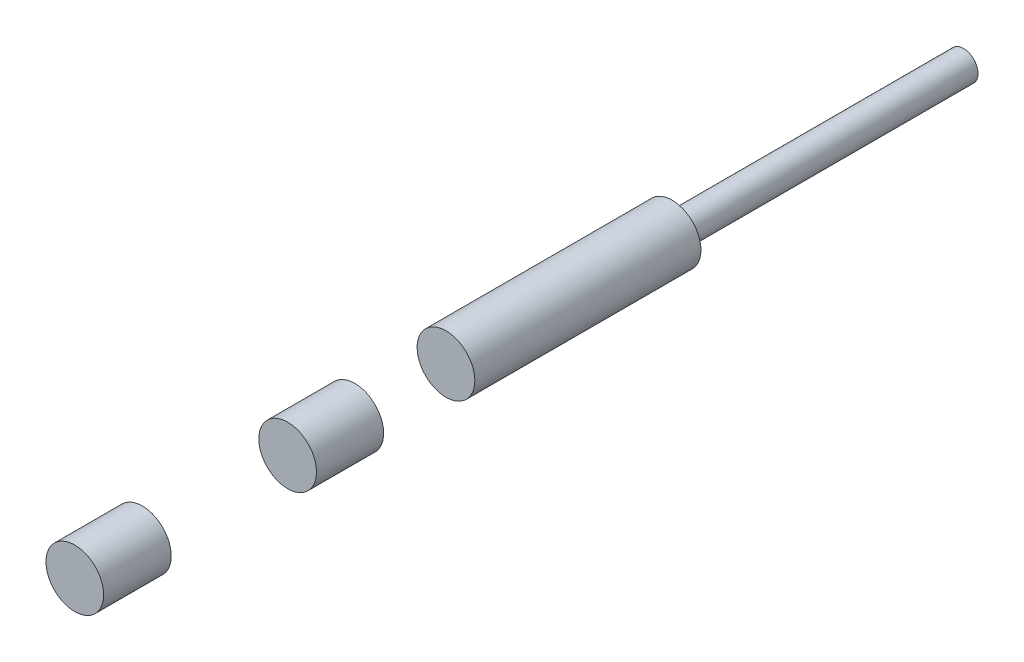
ISO-10303-21;
HEADER;
FILE_DESCRIPTION(('STEP AP214'),'2;1');
FILE_NAME('part.step','',(''),(''),'','','');
FILE_SCHEMA(('AUTOMOTIVE_DESIGN { 1 0 10303 214 1 1 1 1 }'));
ENDSEC;
DATA;
#1=APPLICATION_CONTEXT('core data for automotive mechanical design processes');
#2=APPLICATION_PROTOCOL_DEFINITION('international standard','automotive_design',2000,#1);
#3=PRODUCT_CONTEXT('',#1,'mechanical');
#4=PRODUCT('Part','Part','',(#3));
#5=PRODUCT_RELATED_PRODUCT_CATEGORY('part','',(#4));
#6=PRODUCT_DEFINITION_FORMATION('','',#4);
#7=PRODUCT_DEFINITION_CONTEXT('part definition',#1,'design');
#8=PRODUCT_DEFINITION('design','',#6,#7);
#9=PRODUCT_DEFINITION_SHAPE('','',#8);
#10=(LENGTH_UNIT() NAMED_UNIT(*) SI_UNIT(.MILLI.,.METRE.));
#11=(NAMED_UNIT(*) PLANE_ANGLE_UNIT() SI_UNIT($,.RADIAN.));
#12=(NAMED_UNIT(*) SI_UNIT($,.STERADIAN.) SOLID_ANGLE_UNIT());
#13=UNCERTAINTY_MEASURE_WITH_UNIT(LENGTH_MEASURE(1.E-05),#10,'distance_accuracy_value','');
#14=(GEOMETRIC_REPRESENTATION_CONTEXT(3) GLOBAL_UNCERTAINTY_ASSIGNED_CONTEXT((#13)) GLOBAL_UNIT_ASSIGNED_CONTEXT((#10,
#11,#12)) REPRESENTATION_CONTEXT('',''));
#15=CARTESIAN_POINT('',(0.,0.,0.));
#16=DIRECTION('',(0.,0.,1.));
#17=DIRECTION('',(1.,0.,0.));
#18=AXIS2_PLACEMENT_3D('',#15,#16,#17);
#19=CARTESIAN_POINT('',(0.,0.,-106.));
#20=DIRECTION('',(0.,0.,1.));
#21=DIRECTION('',(1.,0.,0.));
#22=AXIS2_PLACEMENT_3D('',#19,#20,#21);
#23=CYLINDRICAL_SURFACE('',#22,9.9);
#24=CARTESIAN_POINT('',(0.,0.,21.6045352136614));
#25=DIRECTION('',(0.,0.,-1.));
#26=DIRECTION('',(0.,1.,0.));
#27=AXIS2_PLACEMENT_3D('',#24,#25,#26);
#28=CIRCLE('',#27,9.9);
#29=CARTESIAN_POINT('',(0.,9.9,21.6045352136614));
#30=VERTEX_POINT('',#29);
#31=EDGE_CURVE('E12',#30,#30,#28,.F.);
#32=ORIENTED_EDGE('',*,*,#31,.F.);
#33=EDGE_LOOP('',(#32));
#34=FACE_BOUND('',#33,.T.);
#35=CARTESIAN_POINT('',(0.,0.,-56.));
#36=DIRECTION('',(0.,0.,-1.));
#37=DIRECTION('',(-1.,0.,0.));
#38=AXIS2_PLACEMENT_3D('',#35,#36,#37);
#39=CIRCLE('',#38,9.9);
#40=CARTESIAN_POINT('',(-9.9,0.,-56.));
#41=VERTEX_POINT('',#40);
#42=EDGE_CURVE('E70',#41,#41,#39,.T.);
#43=ORIENTED_EDGE('',*,*,#42,.F.);
#44=EDGE_LOOP('',(#43));
#45=FACE_BOUND('',#44,.T.);
#46=ADVANCED_FACE('F55',(#34,#45),#23,.T.);
#47=CARTESIAN_POINT('',(0.,0.,-56.));
#48=DIRECTION('',(0.,0.,-1.));
#49=DIRECTION('',(-1.,0.,0.));
#50=AXIS2_PLACEMENT_3D('',#47,#48,#49);
#51=PLANE('',#50);
#52=CARTESIAN_POINT('',(0.,0.,-56.));
#53=DIRECTION('',(0.,0.,-1.));
#54=DIRECTION('',(-1.,0.,0.));
#55=AXIS2_PLACEMENT_3D('',#52,#53,#54);
#56=CIRCLE('',#55,5.);
#57=CARTESIAN_POINT('',(-5.,0.,-56.));
#58=VERTEX_POINT('',#57);
#59=EDGE_CURVE('E68',#58,#58,#56,.T.);
#60=ORIENTED_EDGE('',*,*,#59,.F.);
#61=EDGE_LOOP('',(#60));
#62=FACE_BOUND('',#61,.T.);
#63=ORIENTED_EDGE('',*,*,#42,.T.);
#64=EDGE_LOOP('',(#63));
#65=FACE_BOUND('',#64,.T.);
#66=ADVANCED_FACE('F80',(#62,#65),#51,.T.);
#67=CARTESIAN_POINT('',(0.,0.,-56.));
#68=DIRECTION('',(0.,0.,-1.));
#69=DIRECTION('',(-1.,0.,0.));
#70=AXIS2_PLACEMENT_3D('',#67,#68,#69);
#71=CYLINDRICAL_SURFACE('',#70,5.);
#72=ORIENTED_EDGE('',*,*,#59,.T.);
#73=EDGE_LOOP('',(#72));
#74=FACE_BOUND('',#73,.T.);
#75=CARTESIAN_POINT('',(0.,0.,-156.));
#76=DIRECTION('',(0.,0.,-1.));
#77=DIRECTION('',(-1.,0.,0.));
#78=AXIS2_PLACEMENT_3D('',#75,#76,#77);
#79=CIRCLE('',#78,5.);
#80=CARTESIAN_POINT('',(-5.,0.,-156.));
#81=VERTEX_POINT('',#80);
#82=EDGE_CURVE('E58',#81,#81,#79,.T.);
#83=ORIENTED_EDGE('',*,*,#82,.F.);
#84=EDGE_LOOP('',(#83));
#85=FACE_BOUND('',#84,.T.);
#86=ADVANCED_FACE('F77',(#74,#85),#71,.T.);
#87=CARTESIAN_POINT('',(0.,0.,-156.));
#88=DIRECTION('',(0.,0.,-1.));
#89=DIRECTION('',(-1.,0.,0.));
#90=AXIS2_PLACEMENT_3D('',#87,#88,#89);
#91=PLANE('',#90);
#92=ORIENTED_EDGE('',*,*,#82,.T.);
#93=EDGE_LOOP('',(#92));
#94=FACE_BOUND('',#93,.T.);
#95=ADVANCED_FACE('F100',(#94),#91,.T.);
#96=CARTESIAN_POINT('',(-80.,20.633864559174,21.6045352136615));
#97=DIRECTION('',(0.,0.,-1.));
#98=DIRECTION('',(0.,1.,0.));
#99=AXIS2_PLACEMENT_3D('',#96,#97,#98);
#100=PLANE('',#99);
#101=ORIENTED_EDGE('',*,*,#31,.T.);
#102=EDGE_LOOP('',(#101));
#103=FACE_BOUND('',#102,.T.);
#104=ADVANCED_FACE('F107',(#103),#100,.F.);
#105=CLOSED_SHELL('',(#46,#66,#86,#95,#104));
#106=MANIFOLD_SOLID_BREP('B2',#105);
#107=CARTESIAN_POINT('',(0.,0.,-106.));
#108=DIRECTION('',(0.,0.,1.));
#109=DIRECTION('',(1.,0.,0.));
#110=AXIS2_PLACEMENT_3D('',#107,#108,#109);
#111=CYLINDRICAL_SURFACE('',#110,9.9);
#112=CARTESIAN_POINT('',(0.,0.,75.940378552819));
#113=DIRECTION('',(0.,0.,-1.));
#114=DIRECTION('',(-1.,0.,0.));
#115=AXIS2_PLACEMENT_3D('',#112,#113,#114);
#116=CIRCLE('',#115,9.9);
#117=CARTESIAN_POINT('',(-9.9,0.,75.940378552819));
#118=VERTEX_POINT('',#117);
#119=EDGE_CURVE('E54',#118,#118,#116,.F.);
#120=ORIENTED_EDGE('',*,*,#119,.F.);
#121=EDGE_LOOP('',(#120));
#122=FACE_BOUND('',#121,.T.);
#123=CARTESIAN_POINT('',(0.,0.,52.899229795075));
#124=DIRECTION('',(0.,0.,1.));
#125=DIRECTION('',(0.,-1.,0.));
#126=AXIS2_PLACEMENT_3D('',#123,#124,#125);
#127=CIRCLE('',#126,9.9);
#128=CARTESIAN_POINT('',(0.,-9.9,52.899229795075));
#129=VERTEX_POINT('',#128);
#130=EDGE_CURVE('E152',#129,#129,#127,.F.);
#131=ORIENTED_EDGE('',*,*,#130,.F.);
#132=EDGE_LOOP('',(#131));
#133=FACE_BOUND('',#132,.T.);
#134=ADVANCED_FACE('F149',(#122,#133),#111,.T.);
#135=CARTESIAN_POINT('',(-80.,20.633864559174,52.899229795075));
#136=DIRECTION('',(0.,0.,1.));
#137=DIRECTION('',(0.,-1.,0.));
#138=AXIS2_PLACEMENT_3D('',#135,#136,#137);
#139=PLANE('',#138);
#140=ORIENTED_EDGE('',*,*,#130,.T.);
#141=EDGE_LOOP('',(#140));
#142=FACE_BOUND('',#141,.T.);
#143=ADVANCED_FACE('F161',(#142),#139,.F.);
#144=CARTESIAN_POINT('',(-80.,20.633864559174,75.940378552819));
#145=DIRECTION('',(0.,0.,-1.));
#146=DIRECTION('',(-1.,0.,0.));
#147=AXIS2_PLACEMENT_3D('',#144,#145,#146);
#148=PLANE('',#147);
#149=ORIENTED_EDGE('',*,*,#119,.T.);
#150=EDGE_LOOP('',(#149));
#151=FACE_BOUND('',#150,.T.);
#152=ADVANCED_FACE('F168',(#151),#148,.F.);
#153=CLOSED_SHELL('',(#134,#143,#152));
#154=MANIFOLD_SOLID_BREP('B7',#153);
#155=CARTESIAN_POINT('',(0.,0.,149.));
#156=DIRECTION('',(0.,0.,1.));
#157=DIRECTION('',(1.,0.,0.));
#158=AXIS2_PLACEMENT_3D('',#155,#156,#157);
#159=PLANE('',#158);
#160=CARTESIAN_POINT('',(0.,0.,149.));
#161=DIRECTION('',(0.,0.,1.));
#162=DIRECTION('',(1.,0.,0.));
#163=AXIS2_PLACEMENT_3D('',#160,#161,#162);
#164=CIRCLE('',#163,9.9);
#165=CARTESIAN_POINT('',(9.9,0.,149.));
#166=VERTEX_POINT('',#165);
#167=EDGE_CURVE('E148',#166,#166,#164,.T.);
#168=ORIENTED_EDGE('',*,*,#167,.T.);
#169=EDGE_LOOP('',(#168));
#170=FACE_BOUND('',#169,.T.);
#171=ADVANCED_FACE('F195',(#170),#159,.T.);
#172=CARTESIAN_POINT('',(0.,0.,-106.));
#173=DIRECTION('',(0.,0.,1.));
#174=DIRECTION('',(1.,0.,0.));
#175=AXIS2_PLACEMENT_3D('',#172,#173,#174);
#176=CYLINDRICAL_SURFACE('',#175,9.9);
#177=CARTESIAN_POINT('',(0.,0.,125.805551237489));
#178=DIRECTION('',(0.,0.,1.));
#179=DIRECTION('',(1.,0.,0.));
#180=AXIS2_PLACEMENT_3D('',#177,#178,#179);
#181=CIRCLE('',#180,9.9);
#182=CARTESIAN_POINT('',(9.9,0.,125.805551237489));
#183=VERTEX_POINT('',#182);
#184=EDGE_CURVE('E199',#183,#183,#181,.F.);
#185=ORIENTED_EDGE('',*,*,#184,.F.);
#186=EDGE_LOOP('',(#185));
#187=FACE_BOUND('',#186,.T.);
#188=ORIENTED_EDGE('',*,*,#167,.F.);
#189=EDGE_LOOP('',(#188));
#190=FACE_BOUND('',#189,.T.);
#191=ADVANCED_FACE('F197',(#187,#190),#176,.T.);
#192=CARTESIAN_POINT('',(-80.,20.633864559174,125.805551237489));
#193=DIRECTION('',(0.,0.,1.));
#194=DIRECTION('',(1.,0.,0.));
#195=AXIS2_PLACEMENT_3D('',#192,#193,#194);
#196=PLANE('',#195);
#197=ORIENTED_EDGE('',*,*,#184,.T.);
#198=EDGE_LOOP('',(#197));
#199=FACE_BOUND('',#198,.T.);
#200=ADVANCED_FACE('F208',(#199),#196,.F.);
#201=CLOSED_SHELL('',(#171,#191,#200));
#202=MANIFOLD_SOLID_BREP('B49',#201);
#203=ADVANCED_BREP_SHAPE_REPRESENTATION('',(#18,#106,#154,#202),#14);
#204=SHAPE_DEFINITION_REPRESENTATION(#9,#203);
ENDSEC;
END-ISO-10303-21;
